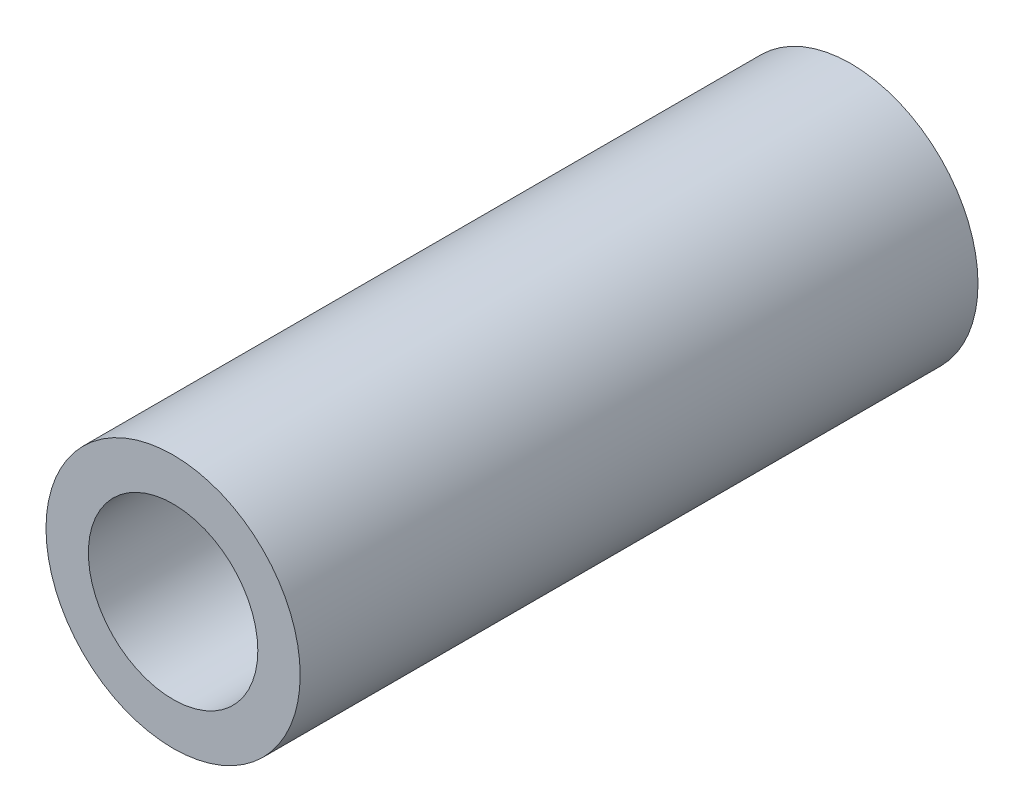
ISO-10303-21;
HEADER;
FILE_DESCRIPTION(('STEP AP214'),'2;1');
FILE_NAME('part.step','',(''),(''),'','','');
FILE_SCHEMA(('AUTOMOTIVE_DESIGN { 1 0 10303 214 1 1 1 1 }'));
ENDSEC;
DATA;
#1=APPLICATION_CONTEXT('core data for automotive mechanical design processes');
#2=APPLICATION_PROTOCOL_DEFINITION('international standard','automotive_design',2000,#1);
#3=PRODUCT_CONTEXT('',#1,'mechanical');
#4=PRODUCT('Part','Part','',(#3));
#5=PRODUCT_RELATED_PRODUCT_CATEGORY('part','',(#4));
#6=PRODUCT_DEFINITION_FORMATION('','',#4);
#7=PRODUCT_DEFINITION_CONTEXT('part definition',#1,'design');
#8=PRODUCT_DEFINITION('design','',#6,#7);
#9=PRODUCT_DEFINITION_SHAPE('','',#8);
#10=(LENGTH_UNIT() NAMED_UNIT(*) SI_UNIT(.MILLI.,.METRE.));
#11=(NAMED_UNIT(*) PLANE_ANGLE_UNIT() SI_UNIT($,.RADIAN.));
#12=(NAMED_UNIT(*) SI_UNIT($,.STERADIAN.) SOLID_ANGLE_UNIT());
#13=UNCERTAINTY_MEASURE_WITH_UNIT(LENGTH_MEASURE(1.E-05),#10,'distance_accuracy_value','');
#14=(GEOMETRIC_REPRESENTATION_CONTEXT(3) GLOBAL_UNCERTAINTY_ASSIGNED_CONTEXT((#13)) GLOBAL_UNIT_ASSIGNED_CONTEXT((#10,
#11,#12)) REPRESENTATION_CONTEXT('',''));
#15=CARTESIAN_POINT('',(0.,0.,0.));
#16=DIRECTION('',(0.,0.,1.));
#17=DIRECTION('',(1.,0.,0.));
#18=AXIS2_PLACEMENT_3D('',#15,#16,#17);
#19=CARTESIAN_POINT('',(0.,0.,12.7));
#20=DIRECTION('',(0.,0.,-1.));
#21=DIRECTION('',(-1.,0.,0.));
#22=AXIS2_PLACEMENT_3D('',#19,#20,#21);
#23=CYLINDRICAL_SURFACE('',#22,4.7625);
#24=CARTESIAN_POINT('',(0.,0.,12.7));
#25=DIRECTION('',(0.,0.,1.));
#26=DIRECTION('',(1.,0.,0.));
#27=AXIS2_PLACEMENT_3D('',#24,#25,#26);
#28=CIRCLE('',#27,4.7625);
#29=CARTESIAN_POINT('',(4.7625,0.,12.7));
#30=VERTEX_POINT('',#29);
#31=EDGE_CURVE('E10',#30,#30,#28,.T.);
#32=ORIENTED_EDGE('',*,*,#31,.F.);
#33=EDGE_LOOP('',(#32));
#34=FACE_BOUND('',#33,.T.);
#35=CARTESIAN_POINT('',(0.,0.,-12.7));
#36=DIRECTION('',(0.,0.,1.));
#37=DIRECTION('',(1.,0.,0.));
#38=AXIS2_PLACEMENT_3D('',#35,#36,#37);
#39=CIRCLE('',#38,4.7625);
#40=CARTESIAN_POINT('',(4.7625,0.,-12.7));
#41=VERTEX_POINT('',#40);
#42=EDGE_CURVE('E35',#41,#41,#39,.T.);
#43=ORIENTED_EDGE('',*,*,#42,.T.);
#44=EDGE_LOOP('',(#43));
#45=FACE_BOUND('',#44,.T.);
#46=ADVANCED_FACE('F32',(#34,#45),#23,.T.);
#47=CARTESIAN_POINT('',(0.,0.,12.7));
#48=DIRECTION('',(0.,0.,1.));
#49=DIRECTION('',(1.,0.,0.));
#50=AXIS2_PLACEMENT_3D('',#47,#48,#49);
#51=PLANE('',#50);
#52=CARTESIAN_POINT('',(0.,0.,12.7));
#53=DIRECTION('',(0.,0.,1.));
#54=DIRECTION('',(1.,0.,0.));
#55=AXIS2_PLACEMENT_3D('',#52,#53,#54);
#56=CIRCLE('',#55,3.175);
#57=CARTESIAN_POINT('',(3.175,0.,12.7));
#58=VERTEX_POINT('',#57);
#59=EDGE_CURVE('E44',#58,#58,#56,.T.);
#60=ORIENTED_EDGE('',*,*,#59,.F.);
#61=EDGE_LOOP('',(#60));
#62=FACE_BOUND('',#61,.T.);
#63=ORIENTED_EDGE('',*,*,#31,.T.);
#64=EDGE_LOOP('',(#63));
#65=FACE_BOUND('',#64,.T.);
#66=ADVANCED_FACE('F59',(#62,#65),#51,.T.);
#67=CARTESIAN_POINT('',(0.,0.,-12.7));
#68=DIRECTION('',(0.,0.,1.));
#69=DIRECTION('',(1.,0.,0.));
#70=AXIS2_PLACEMENT_3D('',#67,#68,#69);
#71=PLANE('',#70);
#72=CARTESIAN_POINT('',(0.,0.,-12.7));
#73=DIRECTION('',(0.,0.,1.));
#74=DIRECTION('',(1.,0.,0.));
#75=AXIS2_PLACEMENT_3D('',#72,#73,#74);
#76=CIRCLE('',#75,3.175);
#77=CARTESIAN_POINT('',(3.175,0.,-12.7));
#78=VERTEX_POINT('',#77);
#79=EDGE_CURVE('E42',#78,#78,#76,.T.);
#80=ORIENTED_EDGE('',*,*,#79,.T.);
#81=EDGE_LOOP('',(#80));
#82=FACE_BOUND('',#81,.T.);
#83=ORIENTED_EDGE('',*,*,#42,.F.);
#84=EDGE_LOOP('',(#83));
#85=FACE_BOUND('',#84,.T.);
#86=ADVANCED_FACE('F50',(#82,#85),#71,.F.);
#87=CARTESIAN_POINT('',(0.,0.,-12.7));
#88=DIRECTION('',(0.,0.,1.));
#89=DIRECTION('',(1.,0.,0.));
#90=AXIS2_PLACEMENT_3D('',#87,#88,#89);
#91=CYLINDRICAL_SURFACE('',#90,3.175);
#92=ORIENTED_EDGE('',*,*,#79,.F.);
#93=EDGE_LOOP('',(#92));
#94=FACE_BOUND('',#93,.T.);
#95=ORIENTED_EDGE('',*,*,#59,.T.);
#96=EDGE_LOOP('',(#95));
#97=FACE_BOUND('',#96,.T.);
#98=ADVANCED_FACE('F53',(#94,#97),#91,.F.);
#99=CLOSED_SHELL('',(#46,#66,#86,#98));
#100=MANIFOLD_SOLID_BREP('B2',#99);
#101=ADVANCED_BREP_SHAPE_REPRESENTATION('',(#18,#100),#14);
#102=SHAPE_DEFINITION_REPRESENTATION(#9,#101);
ENDSEC;
END-ISO-10303-21;
